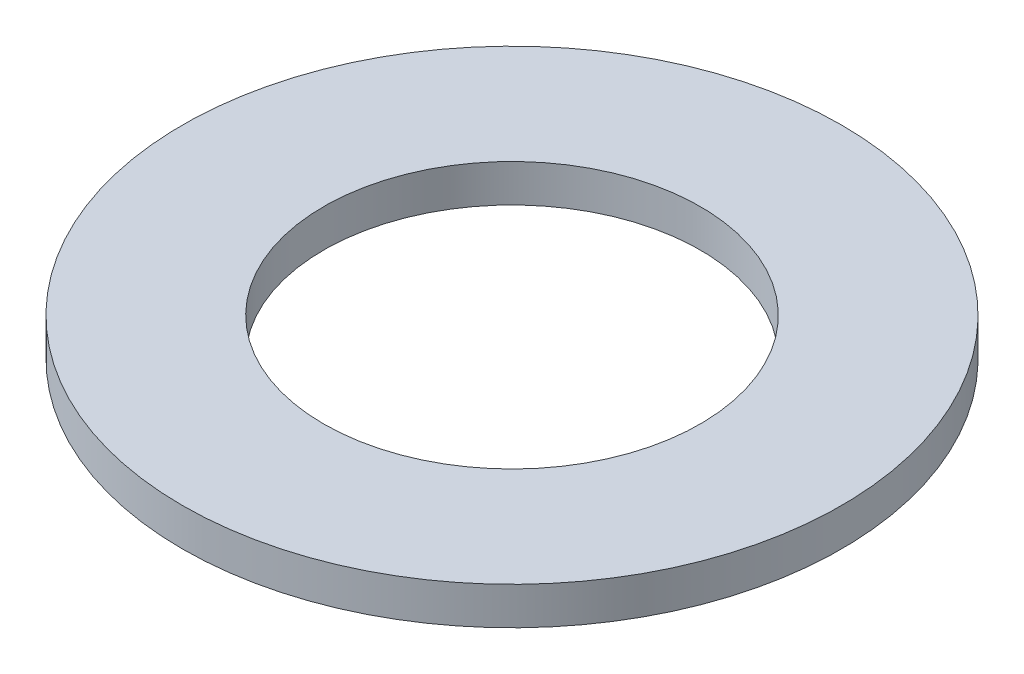
ISO-10303-21;
HEADER;
FILE_DESCRIPTION(('STEP AP214'),'2;1');
FILE_NAME('part.step','',(''),(''),'','','');
FILE_SCHEMA(('AUTOMOTIVE_DESIGN { 1 0 10303 214 1 1 1 1 }'));
ENDSEC;
DATA;
#1=APPLICATION_CONTEXT('core data for automotive mechanical design processes');
#2=APPLICATION_PROTOCOL_DEFINITION('international standard','automotive_design',2000,#1);
#3=PRODUCT_CONTEXT('',#1,'mechanical');
#4=PRODUCT('Part','Part','',(#3));
#5=PRODUCT_RELATED_PRODUCT_CATEGORY('part','',(#4));
#6=PRODUCT_DEFINITION_FORMATION('','',#4);
#7=PRODUCT_DEFINITION_CONTEXT('part definition',#1,'design');
#8=PRODUCT_DEFINITION('design','',#6,#7);
#9=PRODUCT_DEFINITION_SHAPE('','',#8);
#10=(LENGTH_UNIT() NAMED_UNIT(*) SI_UNIT(.MILLI.,.METRE.));
#11=(NAMED_UNIT(*) PLANE_ANGLE_UNIT() SI_UNIT($,.RADIAN.));
#12=(NAMED_UNIT(*) SI_UNIT($,.STERADIAN.) SOLID_ANGLE_UNIT());
#13=UNCERTAINTY_MEASURE_WITH_UNIT(LENGTH_MEASURE(1.E-05),#10,'distance_accuracy_value','');
#14=(GEOMETRIC_REPRESENTATION_CONTEXT(3) GLOBAL_UNCERTAINTY_ASSIGNED_CONTEXT((#13)) GLOBAL_UNIT_ASSIGNED_CONTEXT((#10,
#11,#12)) REPRESENTATION_CONTEXT('',''));
#15=CARTESIAN_POINT('',(0.,0.,0.));
#16=DIRECTION('',(0.,0.,1.));
#17=DIRECTION('',(1.,0.,0.));
#18=AXIS2_PLACEMENT_3D('',#15,#16,#17);
#19=CARTESIAN_POINT('',(0.,6.,0.));
#20=DIRECTION('',(0.,-1.,0.));
#21=DIRECTION('',(0.,0.,-1.));
#22=AXIS2_PLACEMENT_3D('',#19,#20,#21);
#23=CYLINDRICAL_SURFACE('',#22,52.5);
#24=CARTESIAN_POINT('',(0.,6.,0.));
#25=DIRECTION('',(0.,1.,0.));
#26=DIRECTION('',(0.,0.,1.));
#27=AXIS2_PLACEMENT_3D('',#24,#25,#26);
#28=CIRCLE('',#27,52.5);
#29=CARTESIAN_POINT('',(0.,6.,52.5));
#30=VERTEX_POINT('',#29);
#31=EDGE_CURVE('E10',#30,#30,#28,.T.);
#32=ORIENTED_EDGE('',*,*,#31,.F.);
#33=EDGE_LOOP('',(#32));
#34=FACE_BOUND('',#33,.T.);
#35=CARTESIAN_POINT('',(0.,0.,0.));
#36=DIRECTION('',(0.,1.,0.));
#37=DIRECTION('',(0.,0.,1.));
#38=AXIS2_PLACEMENT_3D('',#35,#36,#37);
#39=CIRCLE('',#38,52.5);
#40=CARTESIAN_POINT('',(0.,0.,52.5));
#41=VERTEX_POINT('',#40);
#42=EDGE_CURVE('E37',#41,#41,#39,.T.);
#43=ORIENTED_EDGE('',*,*,#42,.T.);
#44=EDGE_LOOP('',(#43));
#45=FACE_BOUND('',#44,.T.);
#46=ADVANCED_FACE('F40',(#34,#45),#23,.T.);
#47=CARTESIAN_POINT('',(0.,6.,0.));
#48=DIRECTION('',(0.,1.,0.));
#49=DIRECTION('',(0.,0.,1.));
#50=AXIS2_PLACEMENT_3D('',#47,#48,#49);
#51=PLANE('',#50);
#52=CARTESIAN_POINT('',(0.,6.,0.));
#53=DIRECTION('',(0.,1.,0.));
#54=DIRECTION('',(0.,0.,1.));
#55=AXIS2_PLACEMENT_3D('',#52,#53,#54);
#56=CIRCLE('',#55,30.);
#57=CARTESIAN_POINT('',(0.,6.,30.));
#58=VERTEX_POINT('',#57);
#59=EDGE_CURVE('E50',#58,#58,#56,.T.);
#60=ORIENTED_EDGE('',*,*,#59,.F.);
#61=EDGE_LOOP('',(#60));
#62=FACE_BOUND('',#61,.T.);
#63=ORIENTED_EDGE('',*,*,#31,.T.);
#64=EDGE_LOOP('',(#63));
#65=FACE_BOUND('',#64,.T.);
#66=ADVANCED_FACE('F59',(#62,#65),#51,.T.);
#67=CARTESIAN_POINT('',(0.,0.,0.));
#68=DIRECTION('',(0.,1.,0.));
#69=DIRECTION('',(0.,0.,1.));
#70=AXIS2_PLACEMENT_3D('',#67,#68,#69);
#71=PLANE('',#70);
#72=CARTESIAN_POINT('',(0.,0.,0.));
#73=DIRECTION('',(0.,1.,0.));
#74=DIRECTION('',(0.,0.,1.));
#75=AXIS2_PLACEMENT_3D('',#72,#73,#74);
#76=CIRCLE('',#75,30.);
#77=CARTESIAN_POINT('',(0.,0.,30.));
#78=VERTEX_POINT('',#77);
#79=EDGE_CURVE('E47',#78,#78,#76,.T.);
#80=ORIENTED_EDGE('',*,*,#79,.T.);
#81=EDGE_LOOP('',(#80));
#82=FACE_BOUND('',#81,.T.);
#83=ORIENTED_EDGE('',*,*,#42,.F.);
#84=EDGE_LOOP('',(#83));
#85=FACE_BOUND('',#84,.T.);
#86=ADVANCED_FACE('F58',(#82,#85),#71,.F.);
#87=CARTESIAN_POINT('',(0.,6.,0.));
#88=DIRECTION('',(0.,-1.,0.));
#89=DIRECTION('',(0.,0.,-1.));
#90=AXIS2_PLACEMENT_3D('',#87,#88,#89);
#91=CYLINDRICAL_SURFACE('',#90,30.);
#92=ORIENTED_EDGE('',*,*,#59,.T.);
#93=EDGE_LOOP('',(#92));
#94=FACE_BOUND('',#93,.T.);
#95=ORIENTED_EDGE('',*,*,#79,.F.);
#96=EDGE_LOOP('',(#95));
#97=FACE_BOUND('',#96,.T.);
#98=ADVANCED_FACE('F54',(#94,#97),#91,.F.);
#99=CLOSED_SHELL('',(#46,#66,#86,#98));
#100=MANIFOLD_SOLID_BREP('B2',#99);
#101=ADVANCED_BREP_SHAPE_REPRESENTATION('',(#18,#100),#14);
#102=SHAPE_DEFINITION_REPRESENTATION(#9,#101);
ENDSEC;
END-ISO-10303-21;
